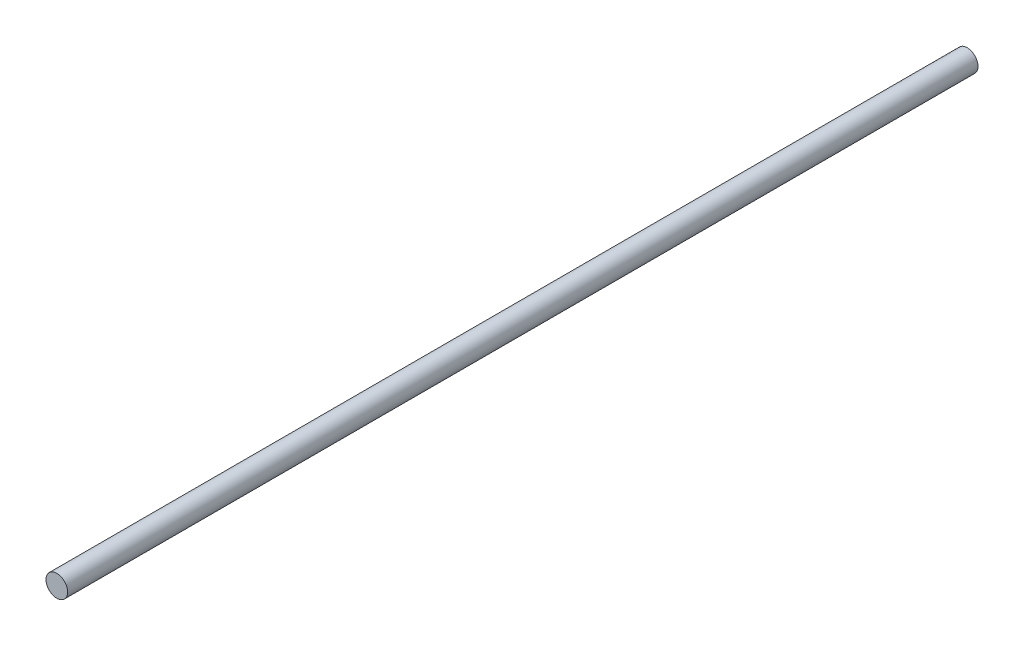
ISO-10303-21;
HEADER;
FILE_DESCRIPTION(('STEP AP214'),'2;1');
FILE_NAME('part.step','',(''),(''),'','','');
FILE_SCHEMA(('AUTOMOTIVE_DESIGN { 1 0 10303 214 1 1 1 1 }'));
ENDSEC;
DATA;
#1=APPLICATION_CONTEXT('core data for automotive mechanical design processes');
#2=APPLICATION_PROTOCOL_DEFINITION('international standard','automotive_design',2000,#1);
#3=PRODUCT_CONTEXT('',#1,'mechanical');
#4=PRODUCT('Part','Part','',(#3));
#5=PRODUCT_RELATED_PRODUCT_CATEGORY('part','',(#4));
#6=PRODUCT_DEFINITION_FORMATION('','',#4);
#7=PRODUCT_DEFINITION_CONTEXT('part definition',#1,'design');
#8=PRODUCT_DEFINITION('design','',#6,#7);
#9=PRODUCT_DEFINITION_SHAPE('','',#8);
#10=(LENGTH_UNIT() NAMED_UNIT(*) SI_UNIT(.MILLI.,.METRE.));
#11=(NAMED_UNIT(*) PLANE_ANGLE_UNIT() SI_UNIT($,.RADIAN.));
#12=(NAMED_UNIT(*) SI_UNIT($,.STERADIAN.) SOLID_ANGLE_UNIT());
#13=UNCERTAINTY_MEASURE_WITH_UNIT(LENGTH_MEASURE(1.E-05),#10,'distance_accuracy_value','');
#14=(GEOMETRIC_REPRESENTATION_CONTEXT(3) GLOBAL_UNCERTAINTY_ASSIGNED_CONTEXT((#13)) GLOBAL_UNIT_ASSIGNED_CONTEXT((#10,
#11,#12)) REPRESENTATION_CONTEXT('',''));
#15=CARTESIAN_POINT('',(0.,0.,0.));
#16=DIRECTION('',(0.,0.,1.));
#17=DIRECTION('',(1.,0.,0.));
#18=AXIS2_PLACEMENT_3D('',#15,#16,#17);
#19=CARTESIAN_POINT('',(0.,0.,160.));
#20=DIRECTION('',(0.,0.,-1.));
#21=DIRECTION('',(-1.,0.,0.));
#22=AXIS2_PLACEMENT_3D('',#19,#20,#21);
#23=CYLINDRICAL_SURFACE('',#22,1.9);
#24=CARTESIAN_POINT('',(0.,0.,160.));
#25=DIRECTION('',(0.,0.,1.));
#26=DIRECTION('',(1.,0.,0.));
#27=AXIS2_PLACEMENT_3D('',#24,#25,#26);
#28=CIRCLE('',#27,1.9);
#29=CARTESIAN_POINT('',(1.9,0.,160.));
#30=VERTEX_POINT('',#29);
#31=EDGE_CURVE('E10',#30,#30,#28,.T.);
#32=ORIENTED_EDGE('',*,*,#31,.F.);
#33=EDGE_LOOP('',(#32));
#34=FACE_BOUND('',#33,.T.);
#35=CARTESIAN_POINT('',(0.,0.,0.));
#36=DIRECTION('',(0.,0.,1.));
#37=DIRECTION('',(1.,0.,0.));
#38=AXIS2_PLACEMENT_3D('',#35,#36,#37);
#39=CIRCLE('',#38,1.9);
#40=CARTESIAN_POINT('',(1.9,0.,0.));
#41=VERTEX_POINT('',#40);
#42=EDGE_CURVE('E40',#41,#41,#39,.T.);
#43=ORIENTED_EDGE('',*,*,#42,.T.);
#44=EDGE_LOOP('',(#43));
#45=FACE_BOUND('',#44,.T.);
#46=ADVANCED_FACE('F37',(#34,#45),#23,.T.);
#47=CARTESIAN_POINT('',(0.,0.,160.));
#48=DIRECTION('',(0.,0.,1.));
#49=DIRECTION('',(1.,0.,0.));
#50=AXIS2_PLACEMENT_3D('',#47,#48,#49);
#51=PLANE('',#50);
#52=ORIENTED_EDGE('',*,*,#31,.T.);
#53=EDGE_LOOP('',(#52));
#54=FACE_BOUND('',#53,.T.);
#55=ADVANCED_FACE('F54',(#54),#51,.T.);
#56=CARTESIAN_POINT('',(0.,0.,0.));
#57=DIRECTION('',(0.,0.,1.));
#58=DIRECTION('',(1.,0.,0.));
#59=AXIS2_PLACEMENT_3D('',#56,#57,#58);
#60=PLANE('',#59);
#61=ORIENTED_EDGE('',*,*,#42,.F.);
#62=EDGE_LOOP('',(#61));
#63=FACE_BOUND('',#62,.T.);
#64=ADVANCED_FACE('F52',(#63),#60,.F.);
#65=CLOSED_SHELL('',(#46,#55,#64));
#66=MANIFOLD_SOLID_BREP('B2',#65);
#67=ADVANCED_BREP_SHAPE_REPRESENTATION('',(#18,#66),#14);
#68=SHAPE_DEFINITION_REPRESENTATION(#9,#67);
ENDSEC;
END-ISO-10303-21;
